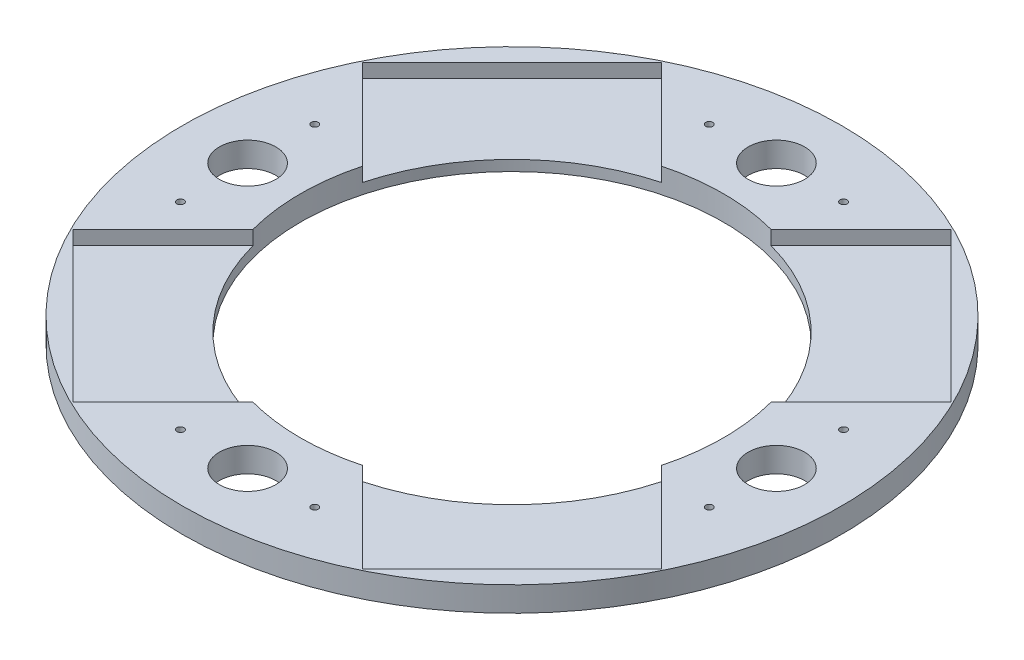
ISO-10303-21;
HEADER;
FILE_DESCRIPTION(('STEP AP214'),'2;1');
FILE_NAME('part.step','',(''),(''),'','','');
FILE_SCHEMA(('AUTOMOTIVE_DESIGN { 1 0 10303 214 1 1 1 1 }'));
ENDSEC;
DATA;
#1=APPLICATION_CONTEXT('core data for automotive mechanical design processes');
#2=APPLICATION_PROTOCOL_DEFINITION('international standard','automotive_design',2000,#1);
#3=PRODUCT_CONTEXT('',#1,'mechanical');
#4=PRODUCT('Part','Part','',(#3));
#5=PRODUCT_RELATED_PRODUCT_CATEGORY('part','',(#4));
#6=PRODUCT_DEFINITION_FORMATION('','',#4);
#7=PRODUCT_DEFINITION_CONTEXT('part definition',#1,'design');
#8=PRODUCT_DEFINITION('design','',#6,#7);
#9=PRODUCT_DEFINITION_SHAPE('','',#8);
#10=(LENGTH_UNIT() NAMED_UNIT(*) SI_UNIT(.MILLI.,.METRE.));
#11=(NAMED_UNIT(*) PLANE_ANGLE_UNIT() SI_UNIT($,.RADIAN.));
#12=(NAMED_UNIT(*) SI_UNIT($,.STERADIAN.) SOLID_ANGLE_UNIT());
#13=UNCERTAINTY_MEASURE_WITH_UNIT(LENGTH_MEASURE(1.E-05),#10,'distance_accuracy_value','');
#14=(GEOMETRIC_REPRESENTATION_CONTEXT(3) GLOBAL_UNCERTAINTY_ASSIGNED_CONTEXT((#13)) GLOBAL_UNIT_ASSIGNED_CONTEXT((#10,
#11,#12)) REPRESENTATION_CONTEXT('',''));
#15=CARTESIAN_POINT('',(0.,0.,0.));
#16=DIRECTION('',(0.,0.,1.));
#17=DIRECTION('',(1.,0.,0.));
#18=AXIS2_PLACEMENT_3D('',#15,#16,#17);
#19=CARTESIAN_POINT('',(0.,7.,0.));
#20=DIRECTION('',(0.,-1.,0.));
#21=DIRECTION('',(0.,0.,-1.));
#22=AXIS2_PLACEMENT_3D('',#19,#20,#21);
#23=CYLINDRICAL_SURFACE('',#22,93.4851226448516);
#24=CARTESIAN_POINT('',(0.,7.,0.));
#25=DIRECTION('',(0.,1.,0.));
#26=DIRECTION('',(0.,0.,1.));
#27=AXIS2_PLACEMENT_3D('',#24,#25,#26);
#28=CIRCLE('',#27,93.4851226448516);
#29=CARTESIAN_POINT('',(0.,7.,93.4851226448516));
#30=VERTEX_POINT('',#29);
#31=EDGE_CURVE('E11',#30,#30,#28,.T.);
#32=ORIENTED_EDGE('',*,*,#31,.F.);
#33=EDGE_LOOP('',(#32));
#34=FACE_BOUND('',#33,.T.);
#35=CARTESIAN_POINT('',(0.,0.,0.));
#36=DIRECTION('',(0.,1.,0.));
#37=DIRECTION('',(0.,0.,1.));
#38=AXIS2_PLACEMENT_3D('',#35,#36,#37);
#39=CIRCLE('',#38,93.4851226448516);
#40=CARTESIAN_POINT('',(0.,0.,93.4851226448516));
#41=VERTEX_POINT('',#40);
#42=EDGE_CURVE('E42',#41,#41,#39,.T.);
#43=ORIENTED_EDGE('',*,*,#42,.T.);
#44=EDGE_LOOP('',(#43));
#45=FACE_BOUND('',#44,.T.);
#46=ADVANCED_FACE('F39',(#34,#45),#23,.T.);
#47=CARTESIAN_POINT('',(0.,7.,0.));
#48=DIRECTION('',(0.,1.,0.));
#49=DIRECTION('',(0.,0.,1.));
#50=AXIS2_PLACEMENT_3D('',#47,#48,#49);
#51=PLANE('',#50);
#52=DIRECTION('',(-0.70710678118655,0.,0.707106781186545));
#53=VECTOR('',#52,1.);
#54=CARTESIAN_POINT('',(-21.2132034355963,7.,-21.2132034355965));
#55=LINE('',#54,#53);
#56=CARTESIAN_POINT('',(-57.9555495773441,7.,15.5291427061511));
#57=VERTEX_POINT('',#56);
#58=CARTESIAN_POINT('',(-83.4706114420347,7.,41.0442045708415));
#59=VERTEX_POINT('',#58);
#60=EDGE_CURVE('E171',#57,#59,#55,.T.);
#61=ORIENTED_EDGE('',*,*,#60,.F.);
#62=CARTESIAN_POINT('',(0.,7.,0.));
#63=DIRECTION('',(0.,1.,0.));
#64=DIRECTION('',(0.,0.,1.));
#65=AXIS2_PLACEMENT_3D('',#62,#63,#64);
#66=CIRCLE('',#65,60.);
#67=CARTESIAN_POINT('',(-57.9555495773441,7.,-15.5291427061512));
#68=VERTEX_POINT('',#67);
#69=EDGE_CURVE('E692',#68,#57,#66,.T.);
#70=ORIENTED_EDGE('',*,*,#69,.F.);
#71=DIRECTION('',(0.707106781186548,0.,0.707106781186547));
#72=VECTOR('',#71,1.);
#73=CARTESIAN_POINT('',(-21.2132034355964,7.,21.2132034355964));
#74=LINE('',#73,#72);
#75=CARTESIAN_POINT('',(-83.4706114420346,7.,-41.0442045708418));
#76=VERTEX_POINT('',#75);
#77=EDGE_CURVE('E201',#76,#68,#74,.T.);
#78=ORIENTED_EDGE('',*,*,#77,.F.);
#79=DIRECTION('',(-0.707106781186547,0.,0.707106781186548));
#80=VECTOR('',#79,1.);
#81=CARTESIAN_POINT('',(-62.2574080064382,7.,-62.2574080064382));
#82=LINE('',#81,#80);
#83=CARTESIAN_POINT('',(-41.0442045708418,7.,-83.4706114420346));
#84=VERTEX_POINT('',#83);
#85=EDGE_CURVE('E198',#84,#76,#82,.T.);
#86=ORIENTED_EDGE('',*,*,#85,.F.);
#87=DIRECTION('',(-0.707106781186548,0.,-0.707106781186547));
#88=VECTOR('',#87,1.);
#89=CARTESIAN_POINT('',(21.2132034355964,7.,-21.2132034355964));
#90=LINE('',#89,#88);
#91=CARTESIAN_POINT('',(-15.5291427061513,7.,-57.9555495773441));
#92=VERTEX_POINT('',#91);
#93=EDGE_CURVE('E190',#92,#84,#90,.T.);
#94=ORIENTED_EDGE('',*,*,#93,.F.);
#95=CARTESIAN_POINT('',(15.5291427061518,7.,-57.9555495773439));
#96=VERTEX_POINT('',#95);
#97=EDGE_CURVE('E274',#96,#92,#66,.T.);
#98=ORIENTED_EDGE('',*,*,#97,.F.);
#99=DIRECTION('',(-0.707106781186555,0.,0.70710678118654));
#100=VECTOR('',#99,1.);
#101=CARTESIAN_POINT('',(-21.2132034355962,7.,-21.2132034355966));
#102=LINE('',#101,#100);
#103=CARTESIAN_POINT('',(41.0442045708426,7.,-83.4706114420342));
#104=VERTEX_POINT('',#103);
#105=EDGE_CURVE('E228',#104,#96,#102,.T.);
#106=ORIENTED_EDGE('',*,*,#105,.F.);
#107=DIRECTION('',(-0.70710678118654,0.,-0.707106781186555));
#108=VECTOR('',#107,1.);
#109=CARTESIAN_POINT('',(62.2574080064388,7.,-62.2574080064376));
#110=LINE('',#109,#108);
#111=CARTESIAN_POINT('',(83.470611442035,7.,-41.0442045708409));
#112=VERTEX_POINT('',#111);
#113=EDGE_CURVE('E225',#112,#104,#110,.T.);
#114=ORIENTED_EDGE('',*,*,#113,.F.);
#115=DIRECTION('',(0.707106781186555,0.,-0.70710678118654));
#116=VECTOR('',#115,1.);
#117=CARTESIAN_POINT('',(21.2132034355962,7.,21.2132034355966));
#118=LINE('',#117,#116);
#119=CARTESIAN_POINT('',(57.9555495773443,7.,-15.5291427061507));
#120=VERTEX_POINT('',#119);
#121=EDGE_CURVE('E217',#120,#112,#118,.T.);
#122=ORIENTED_EDGE('',*,*,#121,.F.);
#123=CARTESIAN_POINT('',(57.9555495773441,7.,15.5291427061512));
#124=VERTEX_POINT('',#123);
#125=EDGE_CURVE('E271',#124,#120,#66,.T.);
#126=ORIENTED_EDGE('',*,*,#125,.F.);
#127=DIRECTION('',(-0.707106781186548,0.,-0.707106781186547));
#128=VECTOR('',#127,1.);
#129=CARTESIAN_POINT('',(21.2132034355964,7.,-21.2132034355964));
#130=LINE('',#129,#128);
#131=CARTESIAN_POINT('',(83.4706114420346,7.,41.0442045708418));
#132=VERTEX_POINT('',#131);
#133=EDGE_CURVE('E253',#132,#124,#130,.T.);
#134=ORIENTED_EDGE('',*,*,#133,.F.);
#135=DIRECTION('',(0.707106781186547,0.,-0.707106781186548));
#136=VECTOR('',#135,1.);
#137=CARTESIAN_POINT('',(62.2574080064382,7.,62.2574080064382));
#138=LINE('',#137,#136);
#139=CARTESIAN_POINT('',(41.0442045708418,7.,83.4706114420346));
#140=VERTEX_POINT('',#139);
#141=EDGE_CURVE('E184',#140,#132,#138,.T.);
#142=ORIENTED_EDGE('',*,*,#141,.F.);
#143=DIRECTION('',(0.707106781186548,0.,0.707106781186547));
#144=VECTOR('',#143,1.);
#145=CARTESIAN_POINT('',(-21.2132034355964,7.,21.2132034355964));
#146=LINE('',#145,#144);
#147=CARTESIAN_POINT('',(15.5291427061513,7.,57.9555495773441));
#148=VERTEX_POINT('',#147);
#149=EDGE_CURVE('E243',#148,#140,#146,.T.);
#150=ORIENTED_EDGE('',*,*,#149,.F.);
#151=CARTESIAN_POINT('',(-15.5291427061514,7.,57.955549577344));
#152=VERTEX_POINT('',#151);
#153=EDGE_CURVE('E259',#152,#148,#66,.T.);
#154=ORIENTED_EDGE('',*,*,#153,.F.);
#155=DIRECTION('',(0.70710678118655,0.,-0.707106781186545));
#156=VECTOR('',#155,1.);
#157=CARTESIAN_POINT('',(21.2132034355964,7.,21.2132034355965));
#158=LINE('',#157,#156);
#159=CARTESIAN_POINT('',(-41.044204570842,7.,83.4706114420345));
#160=VERTEX_POINT('',#159);
#161=EDGE_CURVE('E174',#160,#152,#158,.T.);
#162=ORIENTED_EDGE('',*,*,#161,.F.);
#163=DIRECTION('',(0.707106781186545,0.,0.70710678118655));
#164=VECTOR('',#163,1.);
#165=CARTESIAN_POINT('',(-62.2574080064384,7.,62.257408006438));
#166=LINE('',#165,#164);
#167=EDGE_CURVE('E158',#59,#160,#166,.T.);
#168=ORIENTED_EDGE('',*,*,#167,.F.);
#169=EDGE_LOOP('',(#61,#70,#78,#86,#94,#98,#106,#114,#122,#126,#134,#142,#150,#154,#162,#168));
#170=FACE_BOUND('',#169,.T.);
#171=CARTESIAN_POINT('',(-75.0000000000002,7.,19.0499999999992));
#172=DIRECTION('',(0.,1.,0.));
#173=DIRECTION('',(0.,0.,1.));
#174=AXIS2_PLACEMENT_3D('',#171,#172,#173);
#175=CIRCLE('',#174,0.996949999999996);
#176=CARTESIAN_POINT('',(-75.0000000000002,7.,20.0469499999992));
#177=VERTEX_POINT('',#176);
#178=EDGE_CURVE('E270',#177,#177,#175,.T.);
#179=ORIENTED_EDGE('',*,*,#178,.F.);
#180=EDGE_LOOP('',(#179));
#181=FACE_BOUND('',#180,.T.);
#182=CARTESIAN_POINT('',(-74.9999999999998,7.,-19.0500000000008));
#183=DIRECTION('',(0.,1.,0.));
#184=DIRECTION('',(0.,0.,1.));
#185=AXIS2_PLACEMENT_3D('',#182,#183,#184);
#186=CIRCLE('',#185,0.996949999999996);
#187=CARTESIAN_POINT('',(-74.9999999999998,7.,-18.0530500000008));
#188=VERTEX_POINT('',#187);
#189=EDGE_CURVE('E280',#188,#188,#186,.T.);
#190=ORIENTED_EDGE('',*,*,#189,.F.);
#191=EDGE_LOOP('',(#190));
#192=FACE_BOUND('',#191,.T.);
#193=CARTESIAN_POINT('',(19.05,7.,75.));
#194=DIRECTION('',(0.,1.,0.));
#195=DIRECTION('',(0.,0.,1.));
#196=AXIS2_PLACEMENT_3D('',#193,#194,#195);
#197=CIRCLE('',#196,0.99695);
#198=CARTESIAN_POINT('',(19.05,7.,75.99695));
#199=VERTEX_POINT('',#198);
#200=EDGE_CURVE('E286',#199,#199,#197,.T.);
#201=ORIENTED_EDGE('',*,*,#200,.F.);
#202=EDGE_LOOP('',(#201));
#203=FACE_BOUND('',#202,.T.);
#204=CARTESIAN_POINT('',(-19.05,7.,75.));
#205=DIRECTION('',(0.,1.,0.));
#206=DIRECTION('',(0.,0.,1.));
#207=AXIS2_PLACEMENT_3D('',#204,#205,#206);
#208=CIRCLE('',#207,0.99695);
#209=CARTESIAN_POINT('',(-19.05,7.,75.99695));
#210=VERTEX_POINT('',#209);
#211=EDGE_CURVE('E292',#210,#210,#208,.T.);
#212=ORIENTED_EDGE('',*,*,#211,.F.);
#213=EDGE_LOOP('',(#212));
#214=FACE_BOUND('',#213,.T.);
#215=CARTESIAN_POINT('',(75.0000000000001,7.,-19.0499999999997));
#216=DIRECTION('',(0.,1.,0.));
#217=DIRECTION('',(0.,0.,1.));
#218=AXIS2_PLACEMENT_3D('',#215,#216,#217);
#219=CIRCLE('',#218,0.996949999999996);
#220=CARTESIAN_POINT('',(75.0000000000001,7.,-18.0530499999997));
#221=VERTEX_POINT('',#220);
#222=EDGE_CURVE('E298',#221,#221,#219,.T.);
#223=ORIENTED_EDGE('',*,*,#222,.F.);
#224=EDGE_LOOP('',(#223));
#225=FACE_BOUND('',#224,.T.);
#226=CARTESIAN_POINT('',(74.9999999999999,7.,19.0500000000003));
#227=DIRECTION('',(0.,1.,0.));
#228=DIRECTION('',(0.,0.,1.));
#229=AXIS2_PLACEMENT_3D('',#226,#227,#228);
#230=CIRCLE('',#229,0.996949999999996);
#231=CARTESIAN_POINT('',(74.9999999999999,7.,20.0469500000003));
#232=VERTEX_POINT('',#231);
#233=EDGE_CURVE('E304',#232,#232,#230,.T.);
#234=ORIENTED_EDGE('',*,*,#233,.F.);
#235=EDGE_LOOP('',(#234));
#236=FACE_BOUND('',#235,.T.);
#237=CARTESIAN_POINT('',(0.,7.,75.));
#238=DIRECTION('',(0.,1.,0.));
#239=DIRECTION('',(0.,0.,-1.));
#240=AXIS2_PLACEMENT_3D('',#237,#238,#239);
#241=CIRCLE('',#240,8.);
#242=CARTESIAN_POINT('',(0.,7.,67.));
#243=VERTEX_POINT('',#242);
#244=EDGE_CURVE('E315',#243,#243,#241,.T.);
#245=ORIENTED_EDGE('',*,*,#244,.F.);
#246=EDGE_LOOP('',(#245));
#247=FACE_BOUND('',#246,.T.);
#248=CARTESIAN_POINT('',(-75.,7.,-7.85583301239705E-13));
#249=DIRECTION('',(0.,1.,0.));
#250=DIRECTION('',(1.,0.,0.));
#251=AXIS2_PLACEMENT_3D('',#248,#249,#250);
#252=CIRCLE('',#251,8.);
#253=CARTESIAN_POINT('',(-67.,7.,-7.0178774910747E-13));
#254=VERTEX_POINT('',#253);
#255=EDGE_CURVE('E310',#254,#254,#252,.T.);
#256=ORIENTED_EDGE('',*,*,#255,.F.);
#257=EDGE_LOOP('',(#256));
#258=FACE_BOUND('',#257,.T.);
#259=CARTESIAN_POINT('',(75.,7.,2.61861100413235E-13));
#260=DIRECTION('',(0.,1.,0.));
#261=DIRECTION('',(-1.,0.,0.));
#262=AXIS2_PLACEMENT_3D('',#259,#260,#261);
#263=CIRCLE('',#262,8.);
#264=CARTESIAN_POINT('',(67.,7.,2.3392924970249E-13));
#265=VERTEX_POINT('',#264);
#266=EDGE_CURVE('E314',#265,#265,#263,.T.);
#267=ORIENTED_EDGE('',*,*,#266,.F.);
#268=EDGE_LOOP('',(#267));
#269=FACE_BOUND('',#268,.T.);
#270=CARTESIAN_POINT('',(-19.05,7.,-75.));
#271=DIRECTION('',(0.,1.,0.));
#272=DIRECTION('',(0.,0.,1.));
#273=AXIS2_PLACEMENT_3D('',#270,#271,#272);
#274=CIRCLE('',#273,0.99695);
#275=CARTESIAN_POINT('',(-19.05,7.,-74.00305));
#276=VERTEX_POINT('',#275);
#277=EDGE_CURVE('E326',#276,#276,#274,.T.);
#278=ORIENTED_EDGE('',*,*,#277,.F.);
#279=EDGE_LOOP('',(#278));
#280=FACE_BOUND('',#279,.T.);
#281=CARTESIAN_POINT('',(19.05,7.,-75.));
#282=DIRECTION('',(0.,1.,0.));
#283=DIRECTION('',(0.,0.,1.));
#284=AXIS2_PLACEMENT_3D('',#281,#282,#283);
#285=CIRCLE('',#284,0.99695);
#286=CARTESIAN_POINT('',(19.05,7.,-74.00305));
#287=VERTEX_POINT('',#286);
#288=EDGE_CURVE('E334',#287,#287,#285,.T.);
#289=ORIENTED_EDGE('',*,*,#288,.F.);
#290=EDGE_LOOP('',(#289));
#291=FACE_BOUND('',#290,.T.);
#292=CARTESIAN_POINT('',(0.,7.,-75.));
#293=DIRECTION('',(0.,1.,0.));
#294=DIRECTION('',(0.,0.,1.));
#295=AXIS2_PLACEMENT_3D('',#292,#293,#294);
#296=CIRCLE('',#295,8.);
#297=CARTESIAN_POINT('',(0.,7.,-67.));
#298=VERTEX_POINT('',#297);
#299=EDGE_CURVE('E340',#298,#298,#296,.T.);
#300=ORIENTED_EDGE('',*,*,#299,.F.);
#301=EDGE_LOOP('',(#300));
#302=FACE_BOUND('',#301,.T.);
#303=ORIENTED_EDGE('',*,*,#31,.T.);
#304=EDGE_LOOP('',(#303));
#305=FACE_BOUND('',#304,.T.);
#306=ADVANCED_FACE('F349',(#170,#181,#192,#203,#214,#225,#236,#247,#258,#269,#280,#291,#302,
#305),#51,.T.);
#307=CARTESIAN_POINT('',(0.,0.,0.));
#308=DIRECTION('',(0.,1.,0.));
#309=DIRECTION('',(0.,0.,1.));
#310=AXIS2_PLACEMENT_3D('',#307,#308,#309);
#311=PLANE('',#310);
#312=CARTESIAN_POINT('',(0.,0.,0.));
#313=DIRECTION('',(0.,1.,0.));
#314=DIRECTION('',(0.,0.,1.));
#315=AXIS2_PLACEMENT_3D('',#312,#313,#314);
#316=CIRCLE('',#315,60.);
#317=CARTESIAN_POINT('',(0.,0.,60.));
#318=VERTEX_POINT('',#317);
#319=EDGE_CURVE('E267',#318,#318,#316,.T.);
#320=ORIENTED_EDGE('',*,*,#319,.T.);
#321=EDGE_LOOP('',(#320));
#322=FACE_BOUND('',#321,.T.);
#323=CARTESIAN_POINT('',(-75.0000000000002,0.,19.0499999999992));
#324=DIRECTION('',(0.,1.,0.));
#325=DIRECTION('',(0.,0.,1.));
#326=AXIS2_PLACEMENT_3D('',#323,#324,#325);
#327=CIRCLE('',#326,0.996949999999996);
#328=CARTESIAN_POINT('',(-75.0000000000002,0.,20.0469499999992));
#329=VERTEX_POINT('',#328);
#330=EDGE_CURVE('E277',#329,#329,#327,.T.);
#331=ORIENTED_EDGE('',*,*,#330,.T.);
#332=EDGE_LOOP('',(#331));
#333=FACE_BOUND('',#332,.T.);
#334=CARTESIAN_POINT('',(-74.9999999999998,0.,-19.0500000000008));
#335=DIRECTION('',(0.,1.,0.));
#336=DIRECTION('',(0.,0.,1.));
#337=AXIS2_PLACEMENT_3D('',#334,#335,#336);
#338=CIRCLE('',#337,0.996949999999996);
#339=CARTESIAN_POINT('',(-74.9999999999998,0.,-18.0530500000008));
#340=VERTEX_POINT('',#339);
#341=EDGE_CURVE('E283',#340,#340,#338,.T.);
#342=ORIENTED_EDGE('',*,*,#341,.T.);
#343=EDGE_LOOP('',(#342));
#344=FACE_BOUND('',#343,.T.);
#345=CARTESIAN_POINT('',(19.05,0.,75.));
#346=DIRECTION('',(0.,1.,0.));
#347=DIRECTION('',(0.,0.,1.));
#348=AXIS2_PLACEMENT_3D('',#345,#346,#347);
#349=CIRCLE('',#348,0.99695);
#350=CARTESIAN_POINT('',(19.05,0.,75.99695));
#351=VERTEX_POINT('',#350);
#352=EDGE_CURVE('E289',#351,#351,#349,.T.);
#353=ORIENTED_EDGE('',*,*,#352,.T.);
#354=EDGE_LOOP('',(#353));
#355=FACE_BOUND('',#354,.T.);
#356=CARTESIAN_POINT('',(-19.05,0.,75.));
#357=DIRECTION('',(0.,1.,0.));
#358=DIRECTION('',(0.,0.,1.));
#359=AXIS2_PLACEMENT_3D('',#356,#357,#358);
#360=CIRCLE('',#359,0.99695);
#361=CARTESIAN_POINT('',(-19.05,0.,75.99695));
#362=VERTEX_POINT('',#361);
#363=EDGE_CURVE('E295',#362,#362,#360,.T.);
#364=ORIENTED_EDGE('',*,*,#363,.T.);
#365=EDGE_LOOP('',(#364));
#366=FACE_BOUND('',#365,.T.);
#367=CARTESIAN_POINT('',(75.0000000000001,0.,-19.0499999999997));
#368=DIRECTION('',(0.,1.,0.));
#369=DIRECTION('',(0.,0.,1.));
#370=AXIS2_PLACEMENT_3D('',#367,#368,#369);
#371=CIRCLE('',#370,0.996949999999996);
#372=CARTESIAN_POINT('',(75.0000000000001,0.,-18.0530499999997));
#373=VERTEX_POINT('',#372);
#374=EDGE_CURVE('E301',#373,#373,#371,.T.);
#375=ORIENTED_EDGE('',*,*,#374,.T.);
#376=EDGE_LOOP('',(#375));
#377=FACE_BOUND('',#376,.T.);
#378=CARTESIAN_POINT('',(74.9999999999999,0.,19.0500000000003));
#379=DIRECTION('',(0.,1.,0.));
#380=DIRECTION('',(0.,0.,1.));
#381=AXIS2_PLACEMENT_3D('',#378,#379,#380);
#382=CIRCLE('',#381,0.996949999999996);
#383=CARTESIAN_POINT('',(74.9999999999999,0.,20.0469500000003));
#384=VERTEX_POINT('',#383);
#385=EDGE_CURVE('E307',#384,#384,#382,.T.);
#386=ORIENTED_EDGE('',*,*,#385,.T.);
#387=EDGE_LOOP('',(#386));
#388=FACE_BOUND('',#387,.T.);
#389=CARTESIAN_POINT('',(0.,0.,75.));
#390=DIRECTION('',(0.,1.,0.));
#391=DIRECTION('',(0.,0.,-1.));
#392=AXIS2_PLACEMENT_3D('',#389,#390,#391);
#393=CIRCLE('',#392,8.);
#394=CARTESIAN_POINT('',(0.,0.,67.));
#395=VERTEX_POINT('',#394);
#396=EDGE_CURVE('E311',#395,#395,#393,.T.);
#397=ORIENTED_EDGE('',*,*,#396,.T.);
#398=EDGE_LOOP('',(#397));
#399=FACE_BOUND('',#398,.T.);
#400=CARTESIAN_POINT('',(-75.,0.,-7.85583301239705E-13));
#401=DIRECTION('',(0.,1.,0.));
#402=DIRECTION('',(1.,0.,0.));
#403=AXIS2_PLACEMENT_3D('',#400,#401,#402);
#404=CIRCLE('',#403,8.);
#405=CARTESIAN_POINT('',(-67.,0.,-7.0178774910747E-13));
#406=VERTEX_POINT('',#405);
#407=EDGE_CURVE('E318',#406,#406,#404,.T.);
#408=ORIENTED_EDGE('',*,*,#407,.T.);
#409=EDGE_LOOP('',(#408));
#410=FACE_BOUND('',#409,.T.);
#411=CARTESIAN_POINT('',(75.,0.,2.61861100413235E-13));
#412=DIRECTION('',(0.,1.,0.));
#413=DIRECTION('',(-1.,0.,0.));
#414=AXIS2_PLACEMENT_3D('',#411,#412,#413);
#415=CIRCLE('',#414,8.);
#416=CARTESIAN_POINT('',(67.,0.,2.3392924970249E-13));
#417=VERTEX_POINT('',#416);
#418=EDGE_CURVE('E323',#417,#417,#415,.T.);
#419=ORIENTED_EDGE('',*,*,#418,.T.);
#420=EDGE_LOOP('',(#419));
#421=FACE_BOUND('',#420,.T.);
#422=CARTESIAN_POINT('',(-19.05,0.,-75.));
#423=DIRECTION('',(0.,1.,0.));
#424=DIRECTION('',(0.,0.,1.));
#425=AXIS2_PLACEMENT_3D('',#422,#423,#424);
#426=CIRCLE('',#425,0.99695);
#427=CARTESIAN_POINT('',(-19.05,0.,-74.00305));
#428=VERTEX_POINT('',#427);
#429=EDGE_CURVE('E331',#428,#428,#426,.T.);
#430=ORIENTED_EDGE('',*,*,#429,.T.);
#431=EDGE_LOOP('',(#430));
#432=FACE_BOUND('',#431,.T.);
#433=CARTESIAN_POINT('',(19.05,0.,-75.));
#434=DIRECTION('',(0.,1.,0.));
#435=DIRECTION('',(0.,0.,1.));
#436=AXIS2_PLACEMENT_3D('',#433,#434,#435);
#437=CIRCLE('',#436,0.99695);
#438=CARTESIAN_POINT('',(19.05,0.,-74.00305));
#439=VERTEX_POINT('',#438);
#440=EDGE_CURVE('E337',#439,#439,#437,.T.);
#441=ORIENTED_EDGE('',*,*,#440,.T.);
#442=EDGE_LOOP('',(#441));
#443=FACE_BOUND('',#442,.T.);
#444=CARTESIAN_POINT('',(0.,0.,-75.));
#445=DIRECTION('',(0.,1.,0.));
#446=DIRECTION('',(0.,0.,1.));
#447=AXIS2_PLACEMENT_3D('',#444,#445,#446);
#448=CIRCLE('',#447,8.);
#449=CARTESIAN_POINT('',(0.,0.,-67.));
#450=VERTEX_POINT('',#449);
#451=EDGE_CURVE('E341',#450,#450,#448,.T.);
#452=ORIENTED_EDGE('',*,*,#451,.T.);
#453=EDGE_LOOP('',(#452));
#454=FACE_BOUND('',#453,.T.);
#455=ORIENTED_EDGE('',*,*,#42,.F.);
#456=EDGE_LOOP('',(#455));
#457=FACE_BOUND('',#456,.T.);
#458=ADVANCED_FACE('F352',(#322,#333,#344,#355,#366,#377,#388,#399,#410,#421,#432,#443,#454,
#457),#311,.F.);
#459=CARTESIAN_POINT('',(0.,0.,-75.));
#460=DIRECTION('',(0.,1.,0.));
#461=DIRECTION('',(0.,0.,1.));
#462=AXIS2_PLACEMENT_3D('',#459,#460,#461);
#463=CYLINDRICAL_SURFACE('',#462,8.);
#464=ORIENTED_EDGE('',*,*,#451,.F.);
#465=EDGE_LOOP('',(#464));
#466=FACE_BOUND('',#465,.T.);
#467=ORIENTED_EDGE('',*,*,#299,.T.);
#468=EDGE_LOOP('',(#467));
#469=FACE_BOUND('',#468,.T.);
#470=ADVANCED_FACE('F347',(#466,#469),#463,.F.);
#471=CARTESIAN_POINT('',(19.05,7.,-75.));
#472=DIRECTION('',(0.,1.,0.));
#473=DIRECTION('',(0.,0.,1.));
#474=AXIS2_PLACEMENT_3D('',#471,#472,#473);
#475=CYLINDRICAL_SURFACE('',#474,0.99695);
#476=ORIENTED_EDGE('',*,*,#440,.F.);
#477=EDGE_LOOP('',(#476));
#478=FACE_BOUND('',#477,.T.);
#479=ORIENTED_EDGE('',*,*,#288,.T.);
#480=EDGE_LOOP('',(#479));
#481=FACE_BOUND('',#480,.T.);
#482=ADVANCED_FACE('F367',(#478,#481),#475,.F.);
#483=CARTESIAN_POINT('',(-19.05,7.,-75.));
#484=DIRECTION('',(0.,1.,0.));
#485=DIRECTION('',(0.,0.,1.));
#486=AXIS2_PLACEMENT_3D('',#483,#484,#485);
#487=CYLINDRICAL_SURFACE('',#486,0.99695);
#488=ORIENTED_EDGE('',*,*,#429,.F.);
#489=EDGE_LOOP('',(#488));
#490=FACE_BOUND('',#489,.T.);
#491=ORIENTED_EDGE('',*,*,#277,.T.);
#492=EDGE_LOOP('',(#491));
#493=FACE_BOUND('',#492,.T.);
#494=ADVANCED_FACE('F374',(#490,#493),#487,.F.);
#495=CARTESIAN_POINT('',(75.,0.,2.61861100413235E-13));
#496=DIRECTION('',(0.,1.,0.));
#497=DIRECTION('',(0.,0.,1.));
#498=AXIS2_PLACEMENT_3D('',#495,#496,#497);
#499=CYLINDRICAL_SURFACE('',#498,8.);
#500=ORIENTED_EDGE('',*,*,#418,.F.);
#501=EDGE_LOOP('',(#500));
#502=FACE_BOUND('',#501,.T.);
#503=ORIENTED_EDGE('',*,*,#266,.T.);
#504=EDGE_LOOP('',(#503));
#505=FACE_BOUND('',#504,.T.);
#506=ADVANCED_FACE('F378',(#502,#505),#499,.F.);
#507=CARTESIAN_POINT('',(-75.,0.,-7.85583301239705E-13));
#508=DIRECTION('',(0.,1.,0.));
#509=DIRECTION('',(0.,0.,1.));
#510=AXIS2_PLACEMENT_3D('',#507,#508,#509);
#511=CYLINDRICAL_SURFACE('',#510,8.);
#512=ORIENTED_EDGE('',*,*,#407,.F.);
#513=EDGE_LOOP('',(#512));
#514=FACE_BOUND('',#513,.T.);
#515=ORIENTED_EDGE('',*,*,#255,.T.);
#516=EDGE_LOOP('',(#515));
#517=FACE_BOUND('',#516,.T.);
#518=ADVANCED_FACE('F382',(#514,#517),#511,.F.);
#519=CARTESIAN_POINT('',(0.,0.,75.));
#520=DIRECTION('',(0.,1.,0.));
#521=DIRECTION('',(0.,0.,1.));
#522=AXIS2_PLACEMENT_3D('',#519,#520,#521);
#523=CYLINDRICAL_SURFACE('',#522,8.);
#524=ORIENTED_EDGE('',*,*,#396,.F.);
#525=EDGE_LOOP('',(#524));
#526=FACE_BOUND('',#525,.T.);
#527=ORIENTED_EDGE('',*,*,#244,.T.);
#528=EDGE_LOOP('',(#527));
#529=FACE_BOUND('',#528,.T.);
#530=ADVANCED_FACE('F386',(#526,#529),#523,.F.);
#531=CARTESIAN_POINT('',(74.9999999999999,7.,19.0500000000003));
#532=DIRECTION('',(0.,1.,0.));
#533=DIRECTION('',(0.,0.,1.));
#534=AXIS2_PLACEMENT_3D('',#531,#532,#533);
#535=CYLINDRICAL_SURFACE('',#534,0.996949999999996);
#536=ORIENTED_EDGE('',*,*,#385,.F.);
#537=EDGE_LOOP('',(#536));
#538=FACE_BOUND('',#537,.T.);
#539=ORIENTED_EDGE('',*,*,#233,.T.);
#540=EDGE_LOOP('',(#539));
#541=FACE_BOUND('',#540,.T.);
#542=ADVANCED_FACE('F390',(#538,#541),#535,.F.);
#543=CARTESIAN_POINT('',(75.0000000000001,7.,-19.0499999999997));
#544=DIRECTION('',(0.,1.,0.));
#545=DIRECTION('',(0.,0.,1.));
#546=AXIS2_PLACEMENT_3D('',#543,#544,#545);
#547=CYLINDRICAL_SURFACE('',#546,0.996949999999996);
#548=ORIENTED_EDGE('',*,*,#374,.F.);
#549=EDGE_LOOP('',(#548));
#550=FACE_BOUND('',#549,.T.);
#551=ORIENTED_EDGE('',*,*,#222,.T.);
#552=EDGE_LOOP('',(#551));
#553=FACE_BOUND('',#552,.T.);
#554=ADVANCED_FACE('F394',(#550,#553),#547,.F.);
#555=CARTESIAN_POINT('',(-19.05,7.,75.));
#556=DIRECTION('',(0.,1.,0.));
#557=DIRECTION('',(0.,0.,1.));
#558=AXIS2_PLACEMENT_3D('',#555,#556,#557);
#559=CYLINDRICAL_SURFACE('',#558,0.99695);
#560=ORIENTED_EDGE('',*,*,#363,.F.);
#561=EDGE_LOOP('',(#560));
#562=FACE_BOUND('',#561,.T.);
#563=ORIENTED_EDGE('',*,*,#211,.T.);
#564=EDGE_LOOP('',(#563));
#565=FACE_BOUND('',#564,.T.);
#566=ADVANCED_FACE('F398',(#562,#565),#559,.F.);
#567=CARTESIAN_POINT('',(19.05,7.,75.));
#568=DIRECTION('',(0.,1.,0.));
#569=DIRECTION('',(0.,0.,1.));
#570=AXIS2_PLACEMENT_3D('',#567,#568,#569);
#571=CYLINDRICAL_SURFACE('',#570,0.99695);
#572=ORIENTED_EDGE('',*,*,#352,.F.);
#573=EDGE_LOOP('',(#572));
#574=FACE_BOUND('',#573,.T.);
#575=ORIENTED_EDGE('',*,*,#200,.T.);
#576=EDGE_LOOP('',(#575));
#577=FACE_BOUND('',#576,.T.);
#578=ADVANCED_FACE('F402',(#574,#577),#571,.F.);
#579=CARTESIAN_POINT('',(-74.9999999999998,7.,-19.0500000000008));
#580=DIRECTION('',(0.,1.,0.));
#581=DIRECTION('',(0.,0.,1.));
#582=AXIS2_PLACEMENT_3D('',#579,#580,#581);
#583=CYLINDRICAL_SURFACE('',#582,0.996949999999996);
#584=ORIENTED_EDGE('',*,*,#341,.F.);
#585=EDGE_LOOP('',(#584));
#586=FACE_BOUND('',#585,.T.);
#587=ORIENTED_EDGE('',*,*,#189,.T.);
#588=EDGE_LOOP('',(#587));
#589=FACE_BOUND('',#588,.T.);
#590=ADVANCED_FACE('F406',(#586,#589),#583,.F.);
#591=CARTESIAN_POINT('',(-75.0000000000002,7.,19.0499999999992));
#592=DIRECTION('',(0.,1.,0.));
#593=DIRECTION('',(0.,0.,1.));
#594=AXIS2_PLACEMENT_3D('',#591,#592,#593);
#595=CYLINDRICAL_SURFACE('',#594,0.996949999999996);
#596=ORIENTED_EDGE('',*,*,#330,.F.);
#597=EDGE_LOOP('',(#596));
#598=FACE_BOUND('',#597,.T.);
#599=ORIENTED_EDGE('',*,*,#178,.T.);
#600=EDGE_LOOP('',(#599));
#601=FACE_BOUND('',#600,.T.);
#602=ADVANCED_FACE('F410',(#598,#601),#595,.F.);
#603=CARTESIAN_POINT('',(0.,0.,0.));
#604=DIRECTION('',(0.,1.,0.));
#605=DIRECTION('',(0.,0.,1.));
#606=AXIS2_PLACEMENT_3D('',#603,#604,#605);
#607=CYLINDRICAL_SURFACE('',#606,60.);
#608=ORIENTED_EDGE('',*,*,#69,.T.);
#609=DIRECTION('',(0.,1.,0.));
#610=VECTOR('',#609,1.);
#611=CARTESIAN_POINT('',(-57.9555495773441,3.,15.5291427061511));
#612=LINE('',#611,#610);
#613=CARTESIAN_POINT('',(-57.9555495773441,3.,15.5291427061511));
#614=VERTEX_POINT('',#613);
#615=EDGE_CURVE('E185',#614,#57,#612,.T.);
#616=ORIENTED_EDGE('',*,*,#615,.F.);
#617=CARTESIAN_POINT('',(0.,3.,0.));
#618=DIRECTION('',(0.,1.,0.));
#619=DIRECTION('',(-1.,0.,0.));
#620=AXIS2_PLACEMENT_3D('',#617,#618,#619);
#621=CIRCLE('',#620,60.);
#622=CARTESIAN_POINT('',(-15.5291427061514,3.,57.955549577344));
#623=VERTEX_POINT('',#622);
#624=EDGE_CURVE('E167',#623,#614,#621,.F.);
#625=ORIENTED_EDGE('',*,*,#624,.F.);
#626=DIRECTION('',(0.,1.,0.));
#627=VECTOR('',#626,1.);
#628=CARTESIAN_POINT('',(-15.5291427061514,3.,57.955549577344));
#629=LINE('',#628,#627);
#630=EDGE_CURVE('E161',#623,#152,#629,.T.);
#631=ORIENTED_EDGE('',*,*,#630,.T.);
#632=ORIENTED_EDGE('',*,*,#153,.T.);
#633=DIRECTION('',(0.,1.,0.));
#634=VECTOR('',#633,1.);
#635=CARTESIAN_POINT('',(15.5291427061513,3.,57.9555495773441));
#636=LINE('',#635,#634);
#637=CARTESIAN_POINT('',(15.5291427061513,3.,57.9555495773441));
#638=VERTEX_POINT('',#637);
#639=EDGE_CURVE('E260',#638,#148,#636,.T.);
#640=ORIENTED_EDGE('',*,*,#639,.F.);
#641=CARTESIAN_POINT('',(0.,3.,0.));
#642=DIRECTION('',(0.,1.,0.));
#643=DIRECTION('',(0.,0.,1.));
#644=AXIS2_PLACEMENT_3D('',#641,#642,#643);
#645=CIRCLE('',#644,60.);
#646=CARTESIAN_POINT('',(57.9555495773441,3.,15.5291427061512));
#647=VERTEX_POINT('',#646);
#648=EDGE_CURVE('E245',#647,#638,#645,.F.);
#649=ORIENTED_EDGE('',*,*,#648,.F.);
#650=DIRECTION('',(0.,1.,0.));
#651=VECTOR('',#650,1.);
#652=CARTESIAN_POINT('',(57.9555495773441,3.,15.5291427061512));
#653=LINE('',#652,#651);
#654=EDGE_CURVE('E263',#647,#124,#653,.T.);
#655=ORIENTED_EDGE('',*,*,#654,.T.);
#656=ORIENTED_EDGE('',*,*,#125,.T.);
#657=DIRECTION('',(0.,1.,0.));
#658=VECTOR('',#657,1.);
#659=CARTESIAN_POINT('',(57.9555495773443,3.,-15.5291427061507));
#660=LINE('',#659,#658);
#661=CARTESIAN_POINT('',(57.9555495773443,3.,-15.5291427061507));
#662=VERTEX_POINT('',#661);
#663=EDGE_CURVE('E233',#662,#120,#660,.T.);
#664=ORIENTED_EDGE('',*,*,#663,.F.);
#665=CARTESIAN_POINT('',(0.,3.,0.));
#666=DIRECTION('',(0.,1.,0.));
#667=DIRECTION('',(1.,0.,0.));
#668=AXIS2_PLACEMENT_3D('',#665,#666,#667);
#669=CIRCLE('',#668,60.);
#670=CARTESIAN_POINT('',(15.5291427061518,3.,-57.9555495773439));
#671=VERTEX_POINT('',#670);
#672=EDGE_CURVE('E219',#671,#662,#669,.F.);
#673=ORIENTED_EDGE('',*,*,#672,.F.);
#674=DIRECTION('',(0.,1.,0.));
#675=VECTOR('',#674,1.);
#676=CARTESIAN_POINT('',(15.5291427061518,3.,-57.9555495773439));
#677=LINE('',#676,#675);
#678=EDGE_CURVE('E235',#671,#96,#677,.T.);
#679=ORIENTED_EDGE('',*,*,#678,.T.);
#680=ORIENTED_EDGE('',*,*,#97,.T.);
#681=DIRECTION('',(0.,1.,0.));
#682=VECTOR('',#681,1.);
#683=CARTESIAN_POINT('',(-15.5291427061513,3.,-57.9555495773441));
#684=LINE('',#683,#682);
#685=CARTESIAN_POINT('',(-15.5291427061513,3.,-57.9555495773441));
#686=VERTEX_POINT('',#685);
#687=EDGE_CURVE('E207',#686,#92,#684,.T.);
#688=ORIENTED_EDGE('',*,*,#687,.F.);
#689=CARTESIAN_POINT('',(0.,3.,0.));
#690=DIRECTION('',(0.,1.,0.));
#691=DIRECTION('',(0.,0.,-1.));
#692=AXIS2_PLACEMENT_3D('',#689,#690,#691);
#693=CIRCLE('',#692,60.);
#694=CARTESIAN_POINT('',(-57.9555495773441,3.,-15.5291427061512));
#695=VERTEX_POINT('',#694);
#696=EDGE_CURVE('E192',#695,#686,#693,.F.);
#697=ORIENTED_EDGE('',*,*,#696,.F.);
#698=DIRECTION('',(0.,1.,0.));
#699=VECTOR('',#698,1.);
#700=CARTESIAN_POINT('',(-57.9555495773441,3.,-15.5291427061512));
#701=LINE('',#700,#699);
#702=EDGE_CURVE('E209',#695,#68,#701,.T.);
#703=ORIENTED_EDGE('',*,*,#702,.T.);
#704=EDGE_LOOP('',(#608,#616,#625,#631,#632,#640,#649,#655,#656,#664,#673,#679,#680,#688,#697,#703));
#705=FACE_BOUND('',#704,.T.);
#706=ORIENTED_EDGE('',*,*,#319,.F.);
#707=EDGE_LOOP('',(#706));
#708=FACE_BOUND('',#707,.T.);
#709=ADVANCED_FACE('F414',(#705,#708),#607,.F.);
#710=CARTESIAN_POINT('',(62.2574080064382,3.,62.2574080064382));
#711=DIRECTION('',(0.707106781186548,0.,0.707106781186547));
#712=DIRECTION('',(0.707106781186547,0.,-0.707106781186548));
#713=AXIS2_PLACEMENT_3D('',#710,#711,#712);
#714=PLANE('',#713);
#715=ORIENTED_EDGE('',*,*,#141,.T.);
#716=DIRECTION('',(0.,1.,0.));
#717=VECTOR('',#716,1.);
#718=CARTESIAN_POINT('',(83.4706114420346,3.,41.0442045708418));
#719=LINE('',#718,#717);
#720=CARTESIAN_POINT('',(83.4706114420346,3.,41.0442045708418));
#721=VERTEX_POINT('',#720);
#722=EDGE_CURVE('E250',#721,#132,#719,.T.);
#723=ORIENTED_EDGE('',*,*,#722,.F.);
#724=DIRECTION('',(0.707106781186547,0.,-0.707106781186548));
#725=VECTOR('',#724,1.);
#726=CARTESIAN_POINT('',(62.2574080064382,3.,62.2574080064382));
#727=LINE('',#726,#725);
#728=CARTESIAN_POINT('',(41.0442045708418,3.,83.4706114420346));
#729=VERTEX_POINT('',#728);
#730=EDGE_CURVE('E239',#729,#721,#727,.T.);
#731=ORIENTED_EDGE('',*,*,#730,.F.);
#732=DIRECTION('',(0.,1.,0.));
#733=VECTOR('',#732,1.);
#734=CARTESIAN_POINT('',(41.0442045708418,3.,83.4706114420346));
#735=LINE('',#734,#733);
#736=EDGE_CURVE('E257',#729,#140,#735,.T.);
#737=ORIENTED_EDGE('',*,*,#736,.T.);
#738=EDGE_LOOP('',(#715,#723,#731,#737));
#739=FACE_BOUND('',#738,.T.);
#740=ADVANCED_FACE('F418',(#739),#714,.F.);
#741=CARTESIAN_POINT('',(-21.2132034355964,3.,21.2132034355964));
#742=DIRECTION('',(-0.707106781186547,0.,0.707106781186548));
#743=DIRECTION('',(0.707106781186548,0.,0.707106781186547));
#744=AXIS2_PLACEMENT_3D('',#741,#742,#743);
#745=PLANE('',#744);
#746=ORIENTED_EDGE('',*,*,#149,.T.);
#747=ORIENTED_EDGE('',*,*,#736,.F.);
#748=DIRECTION('',(0.707106781186548,0.,0.707106781186547));
#749=VECTOR('',#748,1.);
#750=CARTESIAN_POINT('',(-21.2132034355964,3.,21.2132034355964));
#751=LINE('',#750,#749);
#752=EDGE_CURVE('E247',#638,#729,#751,.T.);
#753=ORIENTED_EDGE('',*,*,#752,.F.);
#754=ORIENTED_EDGE('',*,*,#639,.T.);
#755=EDGE_LOOP('',(#746,#747,#753,#754));
#756=FACE_BOUND('',#755,.T.);
#757=ADVANCED_FACE('F422',(#756),#745,.F.);
#758=CARTESIAN_POINT('',(21.2132034355964,3.,-21.2132034355964));
#759=DIRECTION('',(0.707106781186547,0.,-0.707106781186548));
#760=DIRECTION('',(-0.707106781186548,0.,-0.707106781186547));
#761=AXIS2_PLACEMENT_3D('',#758,#759,#760);
#762=PLANE('',#761);
#763=ORIENTED_EDGE('',*,*,#133,.T.);
#764=ORIENTED_EDGE('',*,*,#654,.F.);
#765=DIRECTION('',(-0.707106781186548,0.,-0.707106781186547));
#766=VECTOR('',#765,1.);
#767=CARTESIAN_POINT('',(21.2132034355964,3.,-21.2132034355964));
#768=LINE('',#767,#766);
#769=EDGE_CURVE('E242',#721,#647,#768,.T.);
#770=ORIENTED_EDGE('',*,*,#769,.F.);
#771=ORIENTED_EDGE('',*,*,#722,.T.);
#772=EDGE_LOOP('',(#763,#764,#770,#771));
#773=FACE_BOUND('',#772,.T.);
#774=ADVANCED_FACE('F424',(#773),#762,.F.);
#775=CARTESIAN_POINT('',(0.,3.,0.));
#776=DIRECTION('',(0.,1.,0.));
#777=DIRECTION('',(0.,0.,1.));
#778=AXIS2_PLACEMENT_3D('',#775,#776,#777);
#779=PLANE('',#778);
#780=ORIENTED_EDGE('',*,*,#730,.T.);
#781=ORIENTED_EDGE('',*,*,#769,.T.);
#782=ORIENTED_EDGE('',*,*,#648,.T.);
#783=ORIENTED_EDGE('',*,*,#752,.T.);
#784=EDGE_LOOP('',(#780,#781,#782,#783));
#785=FACE_BOUND('',#784,.T.);
#786=ADVANCED_FACE('F427',(#785),#779,.T.);
#787=CARTESIAN_POINT('',(62.2574080064388,3.,-62.2574080064376));
#788=DIRECTION('',(0.707106781186555,0.,-0.70710678118654));
#789=DIRECTION('',(-0.70710678118654,0.,-0.707106781186555));
#790=AXIS2_PLACEMENT_3D('',#787,#788,#789);
#791=PLANE('',#790);
#792=ORIENTED_EDGE('',*,*,#113,.T.);
#793=DIRECTION('',(0.,1.,0.));
#794=VECTOR('',#793,1.);
#795=CARTESIAN_POINT('',(41.0442045708426,3.,-83.4706114420342));
#796=LINE('',#795,#794);
#797=CARTESIAN_POINT('',(41.0442045708426,3.,-83.4706114420342));
#798=VERTEX_POINT('',#797);
#799=EDGE_CURVE('E224',#798,#104,#796,.T.);
#800=ORIENTED_EDGE('',*,*,#799,.F.);
#801=DIRECTION('',(-0.70710678118654,0.,-0.707106781186555));
#802=VECTOR('',#801,1.);
#803=CARTESIAN_POINT('',(62.2574080064388,3.,-62.2574080064376));
#804=LINE('',#803,#802);
#805=CARTESIAN_POINT('',(83.470611442035,3.,-41.0442045708409));
#806=VERTEX_POINT('',#805);
#807=EDGE_CURVE('E213',#806,#798,#804,.T.);
#808=ORIENTED_EDGE('',*,*,#807,.F.);
#809=DIRECTION('',(0.,1.,0.));
#810=VECTOR('',#809,1.);
#811=CARTESIAN_POINT('',(83.470611442035,3.,-41.0442045708409));
#812=LINE('',#811,#810);
#813=EDGE_CURVE('E202',#806,#112,#812,.T.);
#814=ORIENTED_EDGE('',*,*,#813,.T.);
#815=EDGE_LOOP('',(#792,#800,#808,#814));
#816=FACE_BOUND('',#815,.T.);
#817=ADVANCED_FACE('F434',(#816),#791,.F.);
#818=CARTESIAN_POINT('',(21.2132034355962,3.,21.2132034355966));
#819=DIRECTION('',(0.70710678118654,0.,0.707106781186555));
#820=DIRECTION('',(0.707106781186555,0.,-0.70710678118654));
#821=AXIS2_PLACEMENT_3D('',#818,#819,#820);
#822=PLANE('',#821);
#823=ORIENTED_EDGE('',*,*,#121,.T.);
#824=ORIENTED_EDGE('',*,*,#813,.F.);
#825=DIRECTION('',(0.707106781186555,0.,-0.70710678118654));
#826=VECTOR('',#825,1.);
#827=CARTESIAN_POINT('',(21.2132034355962,3.,21.2132034355966));
#828=LINE('',#827,#826);
#829=EDGE_CURVE('E221',#662,#806,#828,.T.);
#830=ORIENTED_EDGE('',*,*,#829,.F.);
#831=ORIENTED_EDGE('',*,*,#663,.T.);
#832=EDGE_LOOP('',(#823,#824,#830,#831));
#833=FACE_BOUND('',#832,.T.);
#834=ADVANCED_FACE('F438',(#833),#822,.F.);
#835=CARTESIAN_POINT('',(-21.2132034355962,3.,-21.2132034355966));
#836=DIRECTION('',(-0.70710678118654,0.,-0.707106781186555));
#837=DIRECTION('',(-0.707106781186555,0.,0.70710678118654));
#838=AXIS2_PLACEMENT_3D('',#835,#836,#837);
#839=PLANE('',#838);
#840=ORIENTED_EDGE('',*,*,#105,.T.);
#841=ORIENTED_EDGE('',*,*,#678,.F.);
#842=DIRECTION('',(-0.707106781186555,0.,0.70710678118654));
#843=VECTOR('',#842,1.);
#844=CARTESIAN_POINT('',(-21.2132034355962,3.,-21.2132034355966));
#845=LINE('',#844,#843);
#846=EDGE_CURVE('E216',#798,#671,#845,.T.);
#847=ORIENTED_EDGE('',*,*,#846,.F.);
#848=ORIENTED_EDGE('',*,*,#799,.T.);
#849=EDGE_LOOP('',(#840,#841,#847,#848));
#850=FACE_BOUND('',#849,.T.);
#851=ADVANCED_FACE('F440',(#850),#839,.F.);
#852=CARTESIAN_POINT('',(0.,3.,0.));
#853=DIRECTION('',(0.,1.,0.));
#854=DIRECTION('',(1.,0.,0.));
#855=AXIS2_PLACEMENT_3D('',#852,#853,#854);
#856=PLANE('',#855);
#857=ORIENTED_EDGE('',*,*,#807,.T.);
#858=ORIENTED_EDGE('',*,*,#846,.T.);
#859=ORIENTED_EDGE('',*,*,#672,.T.);
#860=ORIENTED_EDGE('',*,*,#829,.T.);
#861=EDGE_LOOP('',(#857,#858,#859,#860));
#862=FACE_BOUND('',#861,.T.);
#863=ADVANCED_FACE('F443',(#862),#856,.T.);
#864=CARTESIAN_POINT('',(-62.2574080064382,3.,-62.2574080064382));
#865=DIRECTION('',(-0.707106781186548,0.,-0.707106781186547));
#866=DIRECTION('',(-0.707106781186547,0.,0.707106781186548));
#867=AXIS2_PLACEMENT_3D('',#864,#865,#866);
#868=PLANE('',#867);
#869=ORIENTED_EDGE('',*,*,#85,.T.);
#870=DIRECTION('',(0.,1.,0.));
#871=VECTOR('',#870,1.);
#872=CARTESIAN_POINT('',(-83.4706114420346,3.,-41.0442045708418));
#873=LINE('',#872,#871);
#874=CARTESIAN_POINT('',(-83.4706114420346,3.,-41.0442045708418));
#875=VERTEX_POINT('',#874);
#876=EDGE_CURVE('E197',#875,#76,#873,.T.);
#877=ORIENTED_EDGE('',*,*,#876,.F.);
#878=DIRECTION('',(-0.707106781186547,0.,0.707106781186548));
#879=VECTOR('',#878,1.);
#880=CARTESIAN_POINT('',(-62.2574080064382,3.,-62.2574080064382));
#881=LINE('',#880,#879);
#882=CARTESIAN_POINT('',(-41.0442045708418,3.,-83.4706114420346));
#883=VERTEX_POINT('',#882);
#884=EDGE_CURVE('E188',#883,#875,#881,.T.);
#885=ORIENTED_EDGE('',*,*,#884,.F.);
#886=DIRECTION('',(0.,1.,0.));
#887=VECTOR('',#886,1.);
#888=CARTESIAN_POINT('',(-41.0442045708418,3.,-83.4706114420346));
#889=LINE('',#888,#887);
#890=EDGE_CURVE('E180',#883,#84,#889,.T.);
#891=ORIENTED_EDGE('',*,*,#890,.T.);
#892=EDGE_LOOP('',(#869,#877,#885,#891));
#893=FACE_BOUND('',#892,.T.);
#894=ADVANCED_FACE('F450',(#893),#868,.F.);
#895=CARTESIAN_POINT('',(21.2132034355964,3.,-21.2132034355964));
#896=DIRECTION('',(0.707106781186547,0.,-0.707106781186548));
#897=DIRECTION('',(-0.707106781186548,0.,-0.707106781186547));
#898=AXIS2_PLACEMENT_3D('',#895,#896,#897);
#899=PLANE('',#898);
#900=ORIENTED_EDGE('',*,*,#93,.T.);
#901=ORIENTED_EDGE('',*,*,#890,.F.);
#902=DIRECTION('',(-0.707106781186548,0.,-0.707106781186547));
#903=VECTOR('',#902,1.);
#904=CARTESIAN_POINT('',(21.2132034355964,3.,-21.2132034355964));
#905=LINE('',#904,#903);
#906=EDGE_CURVE('E194',#686,#883,#905,.T.);
#907=ORIENTED_EDGE('',*,*,#906,.F.);
#908=ORIENTED_EDGE('',*,*,#687,.T.);
#909=EDGE_LOOP('',(#900,#901,#907,#908));
#910=FACE_BOUND('',#909,.T.);
#911=ADVANCED_FACE('F454',(#910),#899,.F.);
#912=CARTESIAN_POINT('',(-21.2132034355964,3.,21.2132034355964));
#913=DIRECTION('',(-0.707106781186547,0.,0.707106781186548));
#914=DIRECTION('',(0.707106781186548,0.,0.707106781186547));
#915=AXIS2_PLACEMENT_3D('',#912,#913,#914);
#916=PLANE('',#915);
#917=ORIENTED_EDGE('',*,*,#77,.T.);
#918=ORIENTED_EDGE('',*,*,#702,.F.);
#919=DIRECTION('',(0.707106781186548,0.,0.707106781186547));
#920=VECTOR('',#919,1.);
#921=CARTESIAN_POINT('',(-21.2132034355964,3.,21.2132034355964));
#922=LINE('',#921,#920);
#923=EDGE_CURVE('E61',#875,#695,#922,.T.);
#924=ORIENTED_EDGE('',*,*,#923,.F.);
#925=ORIENTED_EDGE('',*,*,#876,.T.);
#926=EDGE_LOOP('',(#917,#918,#924,#925));
#927=FACE_BOUND('',#926,.T.);
#928=ADVANCED_FACE('F456',(#927),#916,.F.);
#929=CARTESIAN_POINT('',(0.,3.,0.));
#930=DIRECTION('',(0.,1.,0.));
#931=DIRECTION('',(0.,0.,-1.));
#932=AXIS2_PLACEMENT_3D('',#929,#930,#931);
#933=PLANE('',#932);
#934=ORIENTED_EDGE('',*,*,#884,.T.);
#935=ORIENTED_EDGE('',*,*,#923,.T.);
#936=ORIENTED_EDGE('',*,*,#696,.T.);
#937=ORIENTED_EDGE('',*,*,#906,.T.);
#938=EDGE_LOOP('',(#934,#935,#936,#937));
#939=FACE_BOUND('',#938,.T.);
#940=ADVANCED_FACE('F459',(#939),#933,.T.);
#941=CARTESIAN_POINT('',(-62.2574080064384,3.,62.257408006438));
#942=DIRECTION('',(-0.70710678118655,0.,0.707106781186545));
#943=DIRECTION('',(0.707106781186545,0.,0.70710678118655));
#944=AXIS2_PLACEMENT_3D('',#941,#942,#943);
#945=PLANE('',#944);
#946=ORIENTED_EDGE('',*,*,#167,.T.);
#947=DIRECTION('',(0.,1.,0.));
#948=VECTOR('',#947,1.);
#949=CARTESIAN_POINT('',(-41.044204570842,3.,83.4706114420345));
#950=LINE('',#949,#948);
#951=CARTESIAN_POINT('',(-41.044204570842,3.,83.4706114420345));
#952=VERTEX_POINT('',#951);
#953=EDGE_CURVE('E153',#952,#160,#950,.T.);
#954=ORIENTED_EDGE('',*,*,#953,.F.);
#955=DIRECTION('',(0.707106781186545,0.,0.70710678118655));
#956=VECTOR('',#955,1.);
#957=CARTESIAN_POINT('',(-62.2574080064384,3.,62.257408006438));
#958=LINE('',#957,#956);
#959=CARTESIAN_POINT('',(-83.4706114420347,3.,41.0442045708415));
#960=VERTEX_POINT('',#959);
#961=EDGE_CURVE('E155',#960,#952,#958,.T.);
#962=ORIENTED_EDGE('',*,*,#961,.F.);
#963=DIRECTION('',(0.,1.,0.));
#964=VECTOR('',#963,1.);
#965=CARTESIAN_POINT('',(-83.4706114420347,3.,41.0442045708415));
#966=LINE('',#965,#964);
#967=EDGE_CURVE('E182',#960,#59,#966,.T.);
#968=ORIENTED_EDGE('',*,*,#967,.T.);
#969=EDGE_LOOP('',(#946,#954,#962,#968));
#970=FACE_BOUND('',#969,.T.);
#971=ADVANCED_FACE('F154',(#970),#945,.F.);
#972=CARTESIAN_POINT('',(-21.2132034355963,3.,-21.2132034355965));
#973=DIRECTION('',(-0.707106781186545,0.,-0.70710678118655));
#974=DIRECTION('',(-0.70710678118655,0.,0.707106781186545));
#975=AXIS2_PLACEMENT_3D('',#972,#973,#974);
#976=PLANE('',#975);
#977=ORIENTED_EDGE('',*,*,#60,.T.);
#978=ORIENTED_EDGE('',*,*,#967,.F.);
#979=DIRECTION('',(-0.70710678118655,0.,0.707106781186545));
#980=VECTOR('',#979,1.);
#981=CARTESIAN_POINT('',(-21.2132034355963,3.,-21.2132034355965));
#982=LINE('',#981,#980);
#983=EDGE_CURVE('E162',#614,#960,#982,.T.);
#984=ORIENTED_EDGE('',*,*,#983,.F.);
#985=ORIENTED_EDGE('',*,*,#615,.T.);
#986=EDGE_LOOP('',(#977,#978,#984,#985));
#987=FACE_BOUND('',#986,.T.);
#988=ADVANCED_FACE('F468',(#987),#976,.F.);
#989=CARTESIAN_POINT('',(21.2132034355964,3.,21.2132034355965));
#990=DIRECTION('',(0.707106781186545,0.,0.70710678118655));
#991=DIRECTION('',(0.70710678118655,0.,-0.707106781186545));
#992=AXIS2_PLACEMENT_3D('',#989,#990,#991);
#993=PLANE('',#992);
#994=ORIENTED_EDGE('',*,*,#161,.T.);
#995=ORIENTED_EDGE('',*,*,#630,.F.);
#996=DIRECTION('',(0.70710678118655,0.,-0.707106781186545));
#997=VECTOR('',#996,1.);
#998=CARTESIAN_POINT('',(21.2132034355964,3.,21.2132034355965));
#999=LINE('',#998,#997);
#1000=EDGE_CURVE('E53',#952,#623,#999,.T.);
#1001=ORIENTED_EDGE('',*,*,#1000,.F.);
#1002=ORIENTED_EDGE('',*,*,#953,.T.);
#1003=EDGE_LOOP('',(#994,#995,#1001,#1002));
#1004=FACE_BOUND('',#1003,.T.);
#1005=ADVANCED_FACE('F164',(#1004),#993,.F.);
#1006=CARTESIAN_POINT('',(0.,3.,0.));
#1007=DIRECTION('',(0.,1.,0.));
#1008=DIRECTION('',(-1.,0.,0.));
#1009=AXIS2_PLACEMENT_3D('',#1006,#1007,#1008);
#1010=PLANE('',#1009);
#1011=ORIENTED_EDGE('',*,*,#961,.T.);
#1012=ORIENTED_EDGE('',*,*,#1000,.T.);
#1013=ORIENTED_EDGE('',*,*,#624,.T.);
#1014=ORIENTED_EDGE('',*,*,#983,.T.);
#1015=EDGE_LOOP('',(#1011,#1012,#1013,#1014));
#1016=FACE_BOUND('',#1015,.T.);
#1017=ADVANCED_FACE('F169',(#1016),#1010,.T.);
#1018=CLOSED_SHELL('',(#46,#306,#458,#470,#482,#494,#506,#518,#530,#542,#554,#566,#578,#590,
#602,#709,#740,#757,#774,#786,#817,#834,#851,#863,#894,#911,#928,#940,#971,#988,#1005,#1017));
#1019=MANIFOLD_SOLID_BREP('B2',#1018);
#1020=ADVANCED_BREP_SHAPE_REPRESENTATION('',(#18,#1019),#14);
#1021=SHAPE_DEFINITION_REPRESENTATION(#9,#1020);
ENDSEC;
END-ISO-10303-21;
